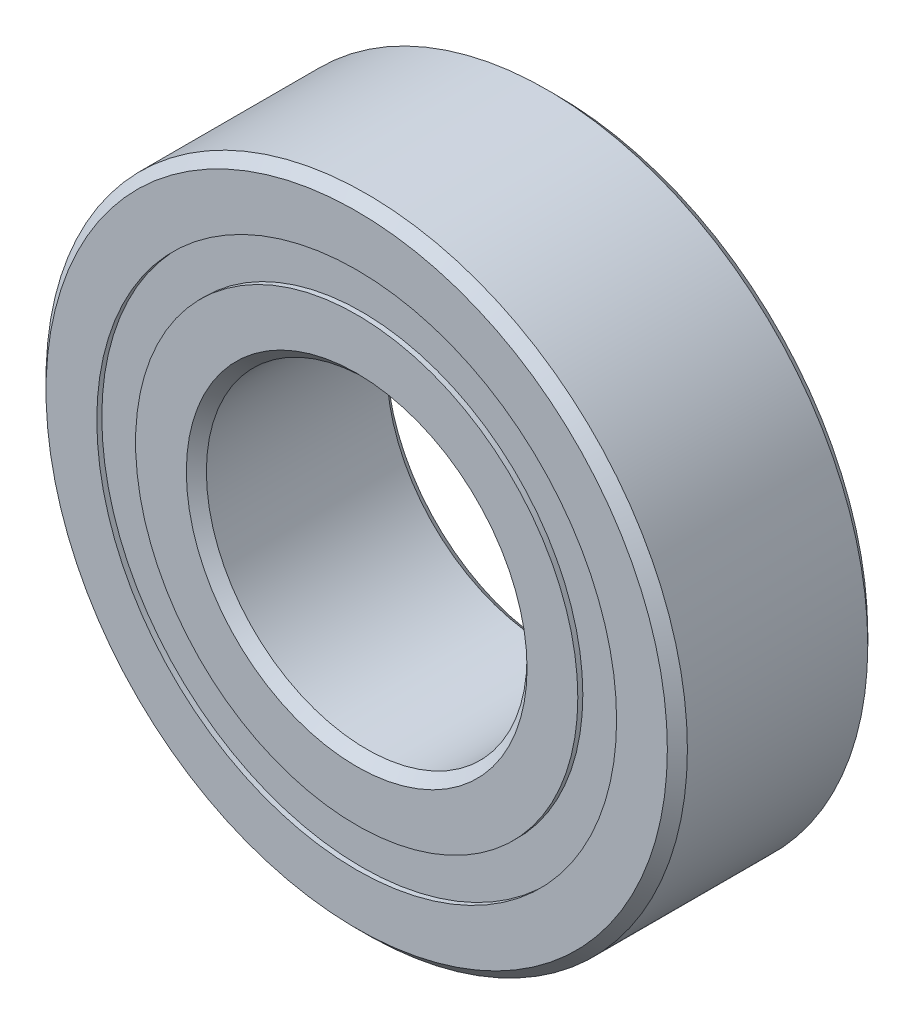
ISO-10303-21;
HEADER;
FILE_DESCRIPTION(('STEP AP214'),'2;1');
FILE_NAME('part.step','',(''),(''),'','','');
FILE_SCHEMA(('AUTOMOTIVE_DESIGN { 1 0 10303 214 1 1 1 1 }'));
ENDSEC;
DATA;
#1=APPLICATION_CONTEXT('core data for automotive mechanical design processes');
#2=APPLICATION_PROTOCOL_DEFINITION('international standard','automotive_design',2000,#1);
#3=PRODUCT_CONTEXT('',#1,'mechanical');
#4=PRODUCT('Part','Part','',(#3));
#5=PRODUCT_RELATED_PRODUCT_CATEGORY('part','',(#4));
#6=PRODUCT_DEFINITION_FORMATION('','',#4);
#7=PRODUCT_DEFINITION_CONTEXT('part definition',#1,'design');
#8=PRODUCT_DEFINITION('design','',#6,#7);
#9=PRODUCT_DEFINITION_SHAPE('','',#8);
#10=(LENGTH_UNIT() NAMED_UNIT(*) SI_UNIT(.MILLI.,.METRE.));
#11=(NAMED_UNIT(*) PLANE_ANGLE_UNIT() SI_UNIT($,.RADIAN.));
#12=(NAMED_UNIT(*) SI_UNIT($,.STERADIAN.) SOLID_ANGLE_UNIT());
#13=UNCERTAINTY_MEASURE_WITH_UNIT(LENGTH_MEASURE(1.E-05),#10,'distance_accuracy_value','');
#14=(GEOMETRIC_REPRESENTATION_CONTEXT(3) GLOBAL_UNCERTAINTY_ASSIGNED_CONTEXT((#13)) GLOBAL_UNIT_ASSIGNED_CONTEXT((#10,
#11,#12)) REPRESENTATION_CONTEXT('',''));
#15=CARTESIAN_POINT('',(0.,0.,0.));
#16=DIRECTION('',(0.,0.,1.));
#17=DIRECTION('',(1.,0.,0.));
#18=AXIS2_PLACEMENT_3D('',#15,#16,#17);
#19=CARTESIAN_POINT('',(0.,6.48351648351648,-2.375));
#20=DIRECTION('',(0.,0.,1.));
#21=DIRECTION('',(1.,0.,0.));
#22=AXIS2_PLACEMENT_3D('',#19,#20,#21);
#23=PLANE('',#22);
#24=CARTESIAN_POINT('',(0.,0.,-2.375));
#25=DIRECTION('',(0.,0.,1.));
#26=DIRECTION('',(1.,0.,0.));
#27=AXIS2_PLACEMENT_3D('',#24,#25,#26);
#28=CIRCLE('',#27,6.48351648351648);
#29=CARTESIAN_POINT('',(6.48351648351648,0.,-2.375));
#30=VERTEX_POINT('',#29);
#31=EDGE_CURVE('E60',#30,#30,#28,.T.);
#32=ORIENTED_EDGE('',*,*,#31,.F.);
#33=EDGE_LOOP('',(#32));
#34=FACE_BOUND('',#33,.T.);
#35=CARTESIAN_POINT('',(0.,0.,-2.375));
#36=DIRECTION('',(0.,0.,1.));
#37=DIRECTION('',(1.,0.,0.));
#38=AXIS2_PLACEMENT_3D('',#35,#36,#37);
#39=CIRCLE('',#38,5.51648351648352);
#40=CARTESIAN_POINT('',(5.51648351648352,0.,-2.375));
#41=VERTEX_POINT('',#40);
#42=EDGE_CURVE('E11',#41,#41,#39,.T.);
#43=ORIENTED_EDGE('',*,*,#42,.T.);
#44=EDGE_LOOP('',(#43));
#45=FACE_BOUND('',#44,.T.);
#46=ADVANCED_FACE('F46',(#34,#45),#23,.F.);
#47=CARTESIAN_POINT('',(0.,0.,2.5));
#48=DIRECTION('',(0.,0.,1.));
#49=DIRECTION('',(1.,0.,0.));
#50=AXIS2_PLACEMENT_3D('',#47,#48,#49);
#51=CYLINDRICAL_SURFACE('',#50,5.51648351648352);
#52=ORIENTED_EDGE('',*,*,#42,.F.);
#53=EDGE_LOOP('',(#52));
#54=FACE_BOUND('',#53,.T.);
#55=CARTESIAN_POINT('',(0.,0.,-1.21175743903915));
#56=DIRECTION('',(0.,0.,1.));
#57=DIRECTION('',(1.,0.,0.));
#58=AXIS2_PLACEMENT_3D('',#55,#56,#57);
#59=CIRCLE('',#58,5.51648351648352);
#60=CARTESIAN_POINT('',(5.51648351648352,0.,-1.21175743903915));
#61=VERTEX_POINT('',#60);
#62=EDGE_CURVE('E52',#61,#61,#59,.T.);
#63=ORIENTED_EDGE('',*,*,#62,.T.);
#64=EDGE_LOOP('',(#63));
#65=FACE_BOUND('',#64,.T.);
#66=ADVANCED_FACE('F69',(#54,#65),#51,.F.);
#67=CARTESIAN_POINT('',(0.,6.48351648351648,-1.21175743903915));
#68=DIRECTION('',(0.,0.,-1.));
#69=DIRECTION('',(-1.,0.,0.));
#70=AXIS2_PLACEMENT_3D('',#67,#68,#69);
#71=PLANE('',#70);
#72=ORIENTED_EDGE('',*,*,#62,.F.);
#73=EDGE_LOOP('',(#72));
#74=FACE_BOUND('',#73,.T.);
#75=CARTESIAN_POINT('',(0.,0.,-1.21175743903915));
#76=DIRECTION('',(0.,0.,1.));
#77=DIRECTION('',(1.,0.,0.));
#78=AXIS2_PLACEMENT_3D('',#75,#76,#77);
#79=CIRCLE('',#78,6.48351648351648);
#80=CARTESIAN_POINT('',(6.48351648351648,0.,-1.21175743903915));
#81=VERTEX_POINT('',#80);
#82=EDGE_CURVE('E56',#81,#81,#79,.T.);
#83=ORIENTED_EDGE('',*,*,#82,.T.);
#84=EDGE_LOOP('',(#83));
#85=FACE_BOUND('',#84,.T.);
#86=ADVANCED_FACE('F73',(#74,#85),#71,.F.);
#87=CARTESIAN_POINT('',(0.,0.,2.5));
#88=DIRECTION('',(0.,0.,1.));
#89=DIRECTION('',(1.,0.,0.));
#90=AXIS2_PLACEMENT_3D('',#87,#88,#89);
#91=CYLINDRICAL_SURFACE('',#90,6.48351648351648);
#92=ORIENTED_EDGE('',*,*,#82,.F.);
#93=EDGE_LOOP('',(#92));
#94=FACE_BOUND('',#93,.T.);
#95=ORIENTED_EDGE('',*,*,#31,.T.);
#96=EDGE_LOOP('',(#95));
#97=FACE_BOUND('',#96,.T.);
#98=ADVANCED_FACE('F66',(#94,#97),#91,.T.);
#99=CLOSED_SHELL('',(#46,#66,#86,#98));
#100=MANIFOLD_SOLID_BREP('B2',#99);
#101=CARTESIAN_POINT('',(0.,6.48351648351648,2.375));
#102=DIRECTION('',(0.,0.,-1.));
#103=DIRECTION('',(-1.,0.,0.));
#104=AXIS2_PLACEMENT_3D('',#101,#102,#103);
#105=PLANE('',#104);
#106=CARTESIAN_POINT('',(0.,0.,2.375));
#107=DIRECTION('',(0.,0.,1.));
#108=DIRECTION('',(1.,0.,0.));
#109=AXIS2_PLACEMENT_3D('',#106,#107,#108);
#110=CIRCLE('',#109,5.51648351648352);
#111=CARTESIAN_POINT('',(5.51648351648352,0.,2.375));
#112=VERTEX_POINT('',#111);
#113=EDGE_CURVE('E45',#112,#112,#110,.T.);
#114=ORIENTED_EDGE('',*,*,#113,.F.);
#115=EDGE_LOOP('',(#114));
#116=FACE_BOUND('',#115,.T.);
#117=CARTESIAN_POINT('',(0.,0.,2.375));
#118=DIRECTION('',(0.,0.,1.));
#119=DIRECTION('',(1.,0.,0.));
#120=AXIS2_PLACEMENT_3D('',#117,#118,#119);
#121=CIRCLE('',#120,6.48351648351648);
#122=CARTESIAN_POINT('',(6.48351648351648,0.,2.375));
#123=VERTEX_POINT('',#122);
#124=EDGE_CURVE('E128',#123,#123,#121,.T.);
#125=ORIENTED_EDGE('',*,*,#124,.T.);
#126=EDGE_LOOP('',(#125));
#127=FACE_BOUND('',#126,.T.);
#128=ADVANCED_FACE('F114',(#116,#127),#105,.F.);
#129=CARTESIAN_POINT('',(0.,0.,2.5));
#130=DIRECTION('',(0.,0.,1.));
#131=DIRECTION('',(1.,0.,0.));
#132=AXIS2_PLACEMENT_3D('',#129,#130,#131);
#133=CYLINDRICAL_SURFACE('',#132,5.51648351648352);
#134=CARTESIAN_POINT('',(0.,0.,1.21175743903915));
#135=DIRECTION('',(0.,0.,1.));
#136=DIRECTION('',(1.,0.,0.));
#137=AXIS2_PLACEMENT_3D('',#134,#135,#136);
#138=CIRCLE('',#137,5.51648351648352);
#139=CARTESIAN_POINT('',(5.51648351648352,0.,1.21175743903915));
#140=VERTEX_POINT('',#139);
#141=EDGE_CURVE('E120',#140,#140,#138,.T.);
#142=ORIENTED_EDGE('',*,*,#141,.F.);
#143=EDGE_LOOP('',(#142));
#144=FACE_BOUND('',#143,.T.);
#145=ORIENTED_EDGE('',*,*,#113,.T.);
#146=EDGE_LOOP('',(#145));
#147=FACE_BOUND('',#146,.T.);
#148=ADVANCED_FACE('F143',(#144,#147),#133,.F.);
#149=CARTESIAN_POINT('',(0.,6.48351648351648,1.21175743903915));
#150=DIRECTION('',(0.,0.,1.));
#151=DIRECTION('',(1.,0.,0.));
#152=AXIS2_PLACEMENT_3D('',#149,#150,#151);
#153=PLANE('',#152);
#154=CARTESIAN_POINT('',(0.,0.,1.21175743903915));
#155=DIRECTION('',(0.,0.,1.));
#156=DIRECTION('',(1.,0.,0.));
#157=AXIS2_PLACEMENT_3D('',#154,#155,#156);
#158=CIRCLE('',#157,6.48351648351648);
#159=CARTESIAN_POINT('',(6.48351648351648,0.,1.21175743903915));
#160=VERTEX_POINT('',#159);
#161=EDGE_CURVE('E124',#160,#160,#158,.T.);
#162=ORIENTED_EDGE('',*,*,#161,.F.);
#163=EDGE_LOOP('',(#162));
#164=FACE_BOUND('',#163,.T.);
#165=ORIENTED_EDGE('',*,*,#141,.T.);
#166=EDGE_LOOP('',(#165));
#167=FACE_BOUND('',#166,.T.);
#168=ADVANCED_FACE('F138',(#164,#167),#153,.F.);
#169=CARTESIAN_POINT('',(0.,0.,2.5));
#170=DIRECTION('',(0.,0.,1.));
#171=DIRECTION('',(1.,0.,0.));
#172=AXIS2_PLACEMENT_3D('',#169,#170,#171);
#173=CYLINDRICAL_SURFACE('',#172,6.48351648351648);
#174=ORIENTED_EDGE('',*,*,#124,.F.);
#175=EDGE_LOOP('',(#174));
#176=FACE_BOUND('',#175,.T.);
#177=ORIENTED_EDGE('',*,*,#161,.T.);
#178=EDGE_LOOP('',(#177));
#179=FACE_BOUND('',#178,.T.);
#180=ADVANCED_FACE('F135',(#176,#179),#173,.T.);
#181=CLOSED_SHELL('',(#128,#148,#168,#180));
#182=MANIFOLD_SOLID_BREP('B6',#181);
#183=CARTESIAN_POINT('',(-2.99999999999993,5.19615242270667,0.));
#184=DIRECTION('',(0.,0.,1.));
#185=DIRECTION('',(-0.499999999999989,0.866025403784445,0.));
#186=AXIS2_PLACEMENT_3D('',#183,#184,#185);
#187=SPHERICAL_SURFACE('',#186,1.21175743903915);
#188=CARTESIAN_POINT('',(-2.99999999999993,5.19615242270667,1.21175743903915));
#189=VERTEX_POINT('',#188);
#190=VERTEX_LOOP('',#189);
#191=FACE_BOUND('',#190,.T.);
#192=ADVANCED_FACE('F182',(#191),#187,.T.);
#193=CLOSED_SHELL('',(#192));
#194=MANIFOLD_SOLID_BREP('B40',#193);
#195=CARTESIAN_POINT('',(-5.1961524227066,3.00000000000006,0.));
#196=DIRECTION('',(0.,0.,1.));
#197=DIRECTION('',(-0.866025403784433,0.50000000000001,0.));
#198=AXIS2_PLACEMENT_3D('',#195,#196,#197);
#199=SPHERICAL_SURFACE('',#198,1.21175743903915);
#200=CARTESIAN_POINT('',(-5.1961524227066,3.00000000000006,1.21175743903915));
#201=VERTEX_POINT('',#200);
#202=VERTEX_LOOP('',#201);
#203=FACE_BOUND('',#202,.T.);
#204=ADVANCED_FACE('F203',(#203),#199,.T.);
#205=CLOSED_SHELL('',(#204));
#206=MANIFOLD_SOLID_BREP('B110',#205);
#207=CARTESIAN_POINT('',(-6.,0.,0.));
#208=DIRECTION('',(0.,0.,1.));
#209=DIRECTION('',(-1.,0.,0.));
#210=AXIS2_PLACEMENT_3D('',#207,#208,#209);
#211=SPHERICAL_SURFACE('',#210,1.21175743903915);
#212=CARTESIAN_POINT('',(-6.,0.,1.21175743903915));
#213=VERTEX_POINT('',#212);
#214=VERTEX_LOOP('',#213);
#215=FACE_BOUND('',#214,.T.);
#216=ADVANCED_FACE('F224',(#215),#211,.T.);
#217=CLOSED_SHELL('',(#216));
#218=MANIFOLD_SOLID_BREP('B178',#217);
#219=CARTESIAN_POINT('',(-5.19615242270666,-2.99999999999995,0.));
#220=DIRECTION('',(0.,0.,1.));
#221=DIRECTION('',(-0.866025403784443,-0.499999999999992,0.));
#222=AXIS2_PLACEMENT_3D('',#219,#220,#221);
#223=SPHERICAL_SURFACE('',#222,1.21175743903915);
#224=CARTESIAN_POINT('',(-5.19615242270666,-2.99999999999995,1.21175743903915));
#225=VERTEX_POINT('',#224);
#226=VERTEX_LOOP('',#225);
#227=FACE_BOUND('',#226,.T.);
#228=ADVANCED_FACE('F245',(#227),#223,.T.);
#229=CLOSED_SHELL('',(#228));
#230=MANIFOLD_SOLID_BREP('B199',#229);
#231=CARTESIAN_POINT('',(-3.00000000000004,-5.19615242270661,0.));
#232=DIRECTION('',(0.,0.,1.));
#233=DIRECTION('',(-0.500000000000007,-0.866025403784435,0.));
#234=AXIS2_PLACEMENT_3D('',#231,#232,#233);
#235=SPHERICAL_SURFACE('',#234,1.21175743903915);
#236=CARTESIAN_POINT('',(-3.00000000000004,-5.19615242270661,1.21175743903915));
#237=VERTEX_POINT('',#236);
#238=VERTEX_LOOP('',#237);
#239=FACE_BOUND('',#238,.T.);
#240=ADVANCED_FACE('F266',(#239),#235,.T.);
#241=CLOSED_SHELL('',(#240));
#242=MANIFOLD_SOLID_BREP('B220',#241);
#243=CARTESIAN_POINT('',(0.,-6.,0.));
#244=DIRECTION('',(0.,0.,1.));
#245=DIRECTION('',(0.,-1.,0.));
#246=AXIS2_PLACEMENT_3D('',#243,#244,#245);
#247=SPHERICAL_SURFACE('',#246,1.21175743903915);
#248=CARTESIAN_POINT('',(0.,-6.,1.21175743903915));
#249=VERTEX_POINT('',#248);
#250=VERTEX_LOOP('',#249);
#251=FACE_BOUND('',#250,.T.);
#252=ADVANCED_FACE('F287',(#251),#247,.T.);
#253=CLOSED_SHELL('',(#252));
#254=MANIFOLD_SOLID_BREP('B241',#253);
#255=CARTESIAN_POINT('',(2.99999999999997,-5.19615242270665,0.));
#256=DIRECTION('',(0.,0.,1.));
#257=DIRECTION('',(0.499999999999995,-0.866025403784442,0.));
#258=AXIS2_PLACEMENT_3D('',#255,#256,#257);
#259=SPHERICAL_SURFACE('',#258,1.21175743903915);
#260=CARTESIAN_POINT('',(2.99999999999997,-5.19615242270665,1.21175743903915));
#261=VERTEX_POINT('',#260);
#262=VERTEX_LOOP('',#261);
#263=FACE_BOUND('',#262,.T.);
#264=ADVANCED_FACE('F308',(#263),#259,.T.);
#265=CLOSED_SHELL('',(#264));
#266=MANIFOLD_SOLID_BREP('B262',#265);
#267=CARTESIAN_POINT('',(5.19615242270662,-3.00000000000002,0.));
#268=DIRECTION('',(0.,0.,1.));
#269=DIRECTION('',(0.866025403784436,-0.500000000000004,0.));
#270=AXIS2_PLACEMENT_3D('',#267,#268,#269);
#271=SPHERICAL_SURFACE('',#270,1.21175743903915);
#272=CARTESIAN_POINT('',(5.19615242270662,-3.00000000000002,1.21175743903915));
#273=VERTEX_POINT('',#272);
#274=VERTEX_LOOP('',#273);
#275=FACE_BOUND('',#274,.T.);
#276=ADVANCED_FACE('F329',(#275),#271,.T.);
#277=CLOSED_SHELL('',(#276));
#278=MANIFOLD_SOLID_BREP('B283',#277);
#279=CARTESIAN_POINT('',(6.,0.,0.));
#280=DIRECTION('',(0.,0.,1.));
#281=DIRECTION('',(1.,0.,0.));
#282=AXIS2_PLACEMENT_3D('',#279,#280,#281);
#283=SPHERICAL_SURFACE('',#282,1.21175743903915);
#284=CARTESIAN_POINT('',(6.,0.,1.21175743903915));
#285=VERTEX_POINT('',#284);
#286=VERTEX_LOOP('',#285);
#287=FACE_BOUND('',#286,.T.);
#288=ADVANCED_FACE('F350',(#287),#283,.T.);
#289=CLOSED_SHELL('',(#288));
#290=MANIFOLD_SOLID_BREP('B304',#289);
#291=CARTESIAN_POINT('',(5.19615242270664,2.99999999999999,0.));
#292=DIRECTION('',(0.,0.,1.));
#293=DIRECTION('',(0.86602540378444,0.499999999999998,0.));
#294=AXIS2_PLACEMENT_3D('',#291,#292,#293);
#295=SPHERICAL_SURFACE('',#294,1.21175743903915);
#296=CARTESIAN_POINT('',(5.19615242270664,2.99999999999999,1.21175743903915));
#297=VERTEX_POINT('',#296);
#298=VERTEX_LOOP('',#297);
#299=FACE_BOUND('',#298,.T.);
#300=ADVANCED_FACE('F371',(#299),#295,.T.);
#301=CLOSED_SHELL('',(#300));
#302=MANIFOLD_SOLID_BREP('B325',#301);
#303=CARTESIAN_POINT('',(3.00000000000001,5.19615242270663,0.));
#304=DIRECTION('',(0.,0.,1.));
#305=DIRECTION('',(0.500000000000001,0.866025403784438,0.));
#306=AXIS2_PLACEMENT_3D('',#303,#304,#305);
#307=SPHERICAL_SURFACE('',#306,1.21175743903915);
#308=CARTESIAN_POINT('',(3.00000000000001,5.19615242270663,1.21175743903915));
#309=VERTEX_POINT('',#308);
#310=VERTEX_LOOP('',#309);
#311=FACE_BOUND('',#310,.T.);
#312=ADVANCED_FACE('F392',(#311),#307,.T.);
#313=CLOSED_SHELL('',(#312));
#314=MANIFOLD_SOLID_BREP('B346',#313);
#315=CARTESIAN_POINT('',(0.,6.,0.));
#316=DIRECTION('',(0.,0.,1.));
#317=DIRECTION('',(0.,1.,0.));
#318=AXIS2_PLACEMENT_3D('',#315,#316,#317);
#319=SPHERICAL_SURFACE('',#318,1.21175743903915);
#320=CARTESIAN_POINT('',(0.,6.,1.21175743903915));
#321=VERTEX_POINT('',#320);
#322=VERTEX_LOOP('',#321);
#323=FACE_BOUND('',#322,.T.);
#324=ADVANCED_FACE('F415',(#323),#319,.T.);
#325=CLOSED_SHELL('',(#324));
#326=MANIFOLD_SOLID_BREP('B367',#325);
#327=CARTESIAN_POINT('',(0.,5.51648351648352,2.5));
#328=DIRECTION('',(0.,0.,-1.));
#329=DIRECTION('',(-1.,0.,0.));
#330=AXIS2_PLACEMENT_3D('',#327,#328,#329);
#331=PLANE('',#330);
#332=CARTESIAN_POINT('',(0.,0.,2.5));
#333=DIRECTION('',(0.,0.,1.));
#334=DIRECTION('',(1.,0.,0.));
#335=AXIS2_PLACEMENT_3D('',#332,#333,#334);
#336=CIRCLE('',#335,4.25);
#337=CARTESIAN_POINT('',(4.25,0.,2.5));
#338=VERTEX_POINT('',#337);
#339=EDGE_CURVE('E463',#338,#338,#336,.T.);
#340=ORIENTED_EDGE('',*,*,#339,.F.);
#341=EDGE_LOOP('',(#340));
#342=FACE_BOUND('',#341,.T.);
#343=CARTESIAN_POINT('',(0.,0.,2.5));
#344=DIRECTION('',(0.,0.,1.));
#345=DIRECTION('',(1.,0.,0.));
#346=AXIS2_PLACEMENT_3D('',#343,#344,#345);
#347=CIRCLE('',#346,5.51648351648352);
#348=CARTESIAN_POINT('',(5.51648351648352,0.,2.5));
#349=VERTEX_POINT('',#348);
#350=EDGE_CURVE('E414',#349,#349,#347,.T.);
#351=ORIENTED_EDGE('',*,*,#350,.T.);
#352=EDGE_LOOP('',(#351));
#353=FACE_BOUND('',#352,.T.);
#354=ADVANCED_FACE('F435',(#342,#353),#331,.F.);
#355=CARTESIAN_POINT('',(0.,0.,2.5));
#356=DIRECTION('',(0.,0.,1.));
#357=DIRECTION('',(1.,0.,0.));
#358=AXIS2_PLACEMENT_3D('',#355,#356,#357);
#359=CYLINDRICAL_SURFACE('',#358,5.51648351648352);
#360=ORIENTED_EDGE('',*,*,#350,.F.);
#361=EDGE_LOOP('',(#360));
#362=FACE_BOUND('',#361,.T.);
#363=CARTESIAN_POINT('',(0.,0.,1.11111111111111));
#364=DIRECTION('',(0.,0.,1.));
#365=DIRECTION('',(1.,0.,0.));
#366=AXIS2_PLACEMENT_3D('',#363,#364,#365);
#367=CIRCLE('',#366,5.51648351648352);
#368=CARTESIAN_POINT('',(5.51648351648352,0.,1.11111111111111));
#369=VERTEX_POINT('',#368);
#370=EDGE_CURVE('E441',#369,#369,#367,.T.);
#371=ORIENTED_EDGE('',*,*,#370,.T.);
#372=EDGE_LOOP('',(#371));
#373=FACE_BOUND('',#372,.T.);
#374=ADVANCED_FACE('F470',(#362,#373),#359,.T.);
#375=CARTESIAN_POINT('',(0.,0.,0.));
#376=DIRECTION('',(0.,0.,1.));
#377=DIRECTION('',(1.,0.,0.));
#378=AXIS2_PLACEMENT_3D('',#375,#376,#377);
#379=TOROIDAL_SURFACE('',#378,6.,1.21175743903915);
#380=ORIENTED_EDGE('',*,*,#370,.F.);
#381=EDGE_LOOP('',(#380));
#382=FACE_BOUND('',#381,.T.);
#383=CARTESIAN_POINT('',(0.,0.,-1.11111111111111));
#384=DIRECTION('',(0.,0.,1.));
#385=DIRECTION('',(1.,0.,0.));
#386=AXIS2_PLACEMENT_3D('',#383,#384,#385);
#387=CIRCLE('',#386,5.51648351648352);
#388=CARTESIAN_POINT('',(5.51648351648352,0.,-1.11111111111111));
#389=VERTEX_POINT('',#388);
#390=EDGE_CURVE('E445',#389,#389,#387,.T.);
#391=ORIENTED_EDGE('',*,*,#390,.T.);
#392=EDGE_LOOP('',(#391));
#393=FACE_BOUND('',#392,.T.);
#394=ADVANCED_FACE('F474',(#382,#393),#379,.F.);
#395=CARTESIAN_POINT('',(0.,0.,2.5));
#396=DIRECTION('',(0.,0.,1.));
#397=DIRECTION('',(1.,0.,0.));
#398=AXIS2_PLACEMENT_3D('',#395,#396,#397);
#399=CYLINDRICAL_SURFACE('',#398,5.51648351648352);
#400=ORIENTED_EDGE('',*,*,#390,.F.);
#401=EDGE_LOOP('',(#400));
#402=FACE_BOUND('',#401,.T.);
#403=CARTESIAN_POINT('',(0.,0.,-2.5));
#404=DIRECTION('',(0.,0.,1.));
#405=DIRECTION('',(1.,0.,0.));
#406=AXIS2_PLACEMENT_3D('',#403,#404,#405);
#407=CIRCLE('',#406,5.51648351648352);
#408=CARTESIAN_POINT('',(5.51648351648352,0.,-2.5));
#409=VERTEX_POINT('',#408);
#410=EDGE_CURVE('E449',#409,#409,#407,.T.);
#411=ORIENTED_EDGE('',*,*,#410,.T.);
#412=EDGE_LOOP('',(#411));
#413=FACE_BOUND('',#412,.T.);
#414=ADVANCED_FACE('F479',(#402,#413),#399,.T.);
#415=CARTESIAN_POINT('',(0.,4.25,-2.5));
#416=DIRECTION('',(0.,0.,1.));
#417=DIRECTION('',(1.,0.,0.));
#418=AXIS2_PLACEMENT_3D('',#415,#416,#417);
#419=PLANE('',#418);
#420=ORIENTED_EDGE('',*,*,#410,.F.);
#421=EDGE_LOOP('',(#420));
#422=FACE_BOUND('',#421,.T.);
#423=CARTESIAN_POINT('',(0.,0.,-2.5));
#424=DIRECTION('',(0.,0.,1.));
#425=DIRECTION('',(1.,0.,0.));
#426=AXIS2_PLACEMENT_3D('',#423,#424,#425);
#427=CIRCLE('',#426,4.25);
#428=CARTESIAN_POINT('',(4.25,0.,-2.5));
#429=VERTEX_POINT('',#428);
#430=EDGE_CURVE('E454',#429,#429,#427,.T.);
#431=ORIENTED_EDGE('',*,*,#430,.T.);
#432=EDGE_LOOP('',(#431));
#433=FACE_BOUND('',#432,.T.);
#434=ADVANCED_FACE('F485',(#422,#433),#419,.F.);
#435=CARTESIAN_POINT('',(0.,0.,-2.25));
#436=DIRECTION('',(0.,0.,-1.));
#437=DIRECTION('',(-1.,0.,0.));
#438=AXIS2_PLACEMENT_3D('',#435,#436,#437);
#439=CONICAL_SURFACE('',#438,4.,0.785398163397447);
#440=ORIENTED_EDGE('',*,*,#430,.F.);
#441=EDGE_LOOP('',(#440));
#442=FACE_BOUND('',#441,.T.);
#443=CARTESIAN_POINT('',(0.,0.,-2.25));
#444=DIRECTION('',(0.,0.,1.));
#445=DIRECTION('',(1.,0.,0.));
#446=AXIS2_PLACEMENT_3D('',#443,#444,#445);
#447=CIRCLE('',#446,4.);
#448=CARTESIAN_POINT('',(4.,0.,-2.25));
#449=VERTEX_POINT('',#448);
#450=EDGE_CURVE('E457',#449,#449,#447,.T.);
#451=ORIENTED_EDGE('',*,*,#450,.T.);
#452=EDGE_LOOP('',(#451));
#453=FACE_BOUND('',#452,.T.);
#454=ADVANCED_FACE('F489',(#442,#453),#439,.F.);
#455=CARTESIAN_POINT('',(0.,0.,2.5));
#456=DIRECTION('',(0.,0.,1.));
#457=DIRECTION('',(1.,0.,0.));
#458=AXIS2_PLACEMENT_3D('',#455,#456,#457);
#459=CYLINDRICAL_SURFACE('',#458,4.);
#460=ORIENTED_EDGE('',*,*,#450,.F.);
#461=EDGE_LOOP('',(#460));
#462=FACE_BOUND('',#461,.T.);
#463=CARTESIAN_POINT('',(0.,0.,2.25));
#464=DIRECTION('',(0.,0.,1.));
#465=DIRECTION('',(1.,0.,0.));
#466=AXIS2_PLACEMENT_3D('',#463,#464,#465);
#467=CIRCLE('',#466,4.);
#468=CARTESIAN_POINT('',(4.,0.,2.25));
#469=VERTEX_POINT('',#468);
#470=EDGE_CURVE('E460',#469,#469,#467,.T.);
#471=ORIENTED_EDGE('',*,*,#470,.T.);
#472=EDGE_LOOP('',(#471));
#473=FACE_BOUND('',#472,.T.);
#474=ADVANCED_FACE('F493',(#462,#473),#459,.F.);
#475=CARTESIAN_POINT('',(0.,0.,2.5));
#476=DIRECTION('',(0.,0.,1.));
#477=DIRECTION('',(1.,0.,0.));
#478=AXIS2_PLACEMENT_3D('',#475,#476,#477);
#479=CONICAL_SURFACE('',#478,4.25,0.785398163397452);
#480=ORIENTED_EDGE('',*,*,#470,.F.);
#481=EDGE_LOOP('',(#480));
#482=FACE_BOUND('',#481,.T.);
#483=ORIENTED_EDGE('',*,*,#339,.T.);
#484=EDGE_LOOP('',(#483));
#485=FACE_BOUND('',#484,.T.);
#486=ADVANCED_FACE('F467',(#482,#485),#479,.F.);
#487=CLOSED_SHELL('',(#354,#374,#394,#414,#434,#454,#474,#486));
#488=MANIFOLD_SOLID_BREP('B388',#487);
#489=CARTESIAN_POINT('',(0.,0.,2.25));
#490=DIRECTION('',(0.,0.,-1.));
#491=DIRECTION('',(-1.,0.,0.));
#492=AXIS2_PLACEMENT_3D('',#489,#490,#491);
#493=CONICAL_SURFACE('',#492,8.,0.785398163397448);
#494=CARTESIAN_POINT('',(0.,0.,2.5));
#495=DIRECTION('',(0.,0.,1.));
#496=DIRECTION('',(1.,0.,0.));
#497=AXIS2_PLACEMENT_3D('',#494,#495,#496);
#498=CIRCLE('',#497,7.75);
#499=CARTESIAN_POINT('',(7.75,0.,2.5));
#500=VERTEX_POINT('',#499);
#501=EDGE_CURVE('E585',#500,#500,#498,.T.);
#502=ORIENTED_EDGE('',*,*,#501,.F.);
#503=EDGE_LOOP('',(#502));
#504=FACE_BOUND('',#503,.T.);
#505=CARTESIAN_POINT('',(0.,0.,2.25));
#506=DIRECTION('',(0.,0.,1.));
#507=DIRECTION('',(1.,0.,0.));
#508=AXIS2_PLACEMENT_3D('',#505,#506,#507);
#509=CIRCLE('',#508,8.);
#510=CARTESIAN_POINT('',(8.,0.,2.25));
#511=VERTEX_POINT('',#510);
#512=EDGE_CURVE('E434',#511,#511,#509,.T.);
#513=ORIENTED_EDGE('',*,*,#512,.T.);
#514=EDGE_LOOP('',(#513));
#515=FACE_BOUND('',#514,.T.);
#516=ADVANCED_FACE('F557',(#504,#515),#493,.T.);
#517=CARTESIAN_POINT('',(0.,0.,2.5));
#518=DIRECTION('',(0.,0.,1.));
#519=DIRECTION('',(1.,0.,0.));
#520=AXIS2_PLACEMENT_3D('',#517,#518,#519);
#521=CYLINDRICAL_SURFACE('',#520,8.);
#522=ORIENTED_EDGE('',*,*,#512,.F.);
#523=EDGE_LOOP('',(#522));
#524=FACE_BOUND('',#523,.T.);
#525=CARTESIAN_POINT('',(0.,0.,-2.25));
#526=DIRECTION('',(0.,0.,1.));
#527=DIRECTION('',(1.,0.,0.));
#528=AXIS2_PLACEMENT_3D('',#525,#526,#527);
#529=CIRCLE('',#528,8.);
#530=CARTESIAN_POINT('',(8.,0.,-2.25));
#531=VERTEX_POINT('',#530);
#532=EDGE_CURVE('E563',#531,#531,#529,.T.);
#533=ORIENTED_EDGE('',*,*,#532,.T.);
#534=EDGE_LOOP('',(#533));
#535=FACE_BOUND('',#534,.T.);
#536=ADVANCED_FACE('F592',(#524,#535),#521,.T.);
#537=CARTESIAN_POINT('',(0.,0.,-2.5));
#538=DIRECTION('',(0.,0.,1.));
#539=DIRECTION('',(1.,0.,0.));
#540=AXIS2_PLACEMENT_3D('',#537,#538,#539);
#541=CONICAL_SURFACE('',#540,7.75,0.785398163397447);
#542=ORIENTED_EDGE('',*,*,#532,.F.);
#543=EDGE_LOOP('',(#542));
#544=FACE_BOUND('',#543,.T.);
#545=CARTESIAN_POINT('',(0.,0.,-2.5));
#546=DIRECTION('',(0.,0.,1.));
#547=DIRECTION('',(1.,0.,0.));
#548=AXIS2_PLACEMENT_3D('',#545,#546,#547);
#549=CIRCLE('',#548,7.75);
#550=CARTESIAN_POINT('',(7.75,0.,-2.5));
#551=VERTEX_POINT('',#550);
#552=EDGE_CURVE('E567',#551,#551,#549,.T.);
#553=ORIENTED_EDGE('',*,*,#552,.T.);
#554=EDGE_LOOP('',(#553));
#555=FACE_BOUND('',#554,.T.);
#556=ADVANCED_FACE('F596',(#544,#555),#541,.T.);
#557=CARTESIAN_POINT('',(0.,7.75,-2.5));
#558=DIRECTION('',(0.,0.,1.));
#559=DIRECTION('',(1.,0.,0.));
#560=AXIS2_PLACEMENT_3D('',#557,#558,#559);
#561=PLANE('',#560);
#562=ORIENTED_EDGE('',*,*,#552,.F.);
#563=EDGE_LOOP('',(#562));
#564=FACE_BOUND('',#563,.T.);
#565=CARTESIAN_POINT('',(0.,0.,-2.5));
#566=DIRECTION('',(0.,0.,1.));
#567=DIRECTION('',(1.,0.,0.));
#568=AXIS2_PLACEMENT_3D('',#565,#566,#567);
#569=CIRCLE('',#568,6.48351648351648);
#570=CARTESIAN_POINT('',(6.48351648351648,0.,-2.5));
#571=VERTEX_POINT('',#570);
#572=EDGE_CURVE('E571',#571,#571,#569,.T.);
#573=ORIENTED_EDGE('',*,*,#572,.T.);
#574=EDGE_LOOP('',(#573));
#575=FACE_BOUND('',#574,.T.);
#576=ADVANCED_FACE('F601',(#564,#575),#561,.F.);
#577=CARTESIAN_POINT('',(0.,0.,2.5));
#578=DIRECTION('',(0.,0.,1.));
#579=DIRECTION('',(1.,0.,0.));
#580=AXIS2_PLACEMENT_3D('',#577,#578,#579);
#581=CYLINDRICAL_SURFACE('',#580,6.48351648351648);
#582=ORIENTED_EDGE('',*,*,#572,.F.);
#583=EDGE_LOOP('',(#582));
#584=FACE_BOUND('',#583,.T.);
#585=CARTESIAN_POINT('',(0.,0.,-1.11111111111111));
#586=DIRECTION('',(0.,0.,1.));
#587=DIRECTION('',(1.,0.,0.));
#588=AXIS2_PLACEMENT_3D('',#585,#586,#587);
#589=CIRCLE('',#588,6.48351648351648);
#590=CARTESIAN_POINT('',(6.48351648351648,0.,-1.11111111111111));
#591=VERTEX_POINT('',#590);
#592=EDGE_CURVE('E576',#591,#591,#589,.T.);
#593=ORIENTED_EDGE('',*,*,#592,.T.);
#594=EDGE_LOOP('',(#593));
#595=FACE_BOUND('',#594,.T.);
#596=ADVANCED_FACE('F607',(#584,#595),#581,.F.);
#597=CARTESIAN_POINT('',(0.,0.,0.));
#598=DIRECTION('',(0.,0.,1.));
#599=DIRECTION('',(1.,0.,0.));
#600=AXIS2_PLACEMENT_3D('',#597,#598,#599);
#601=TOROIDAL_SURFACE('',#600,6.,1.21175743903915);
#602=ORIENTED_EDGE('',*,*,#592,.F.);
#603=EDGE_LOOP('',(#602));
#604=FACE_BOUND('',#603,.T.);
#605=CARTESIAN_POINT('',(0.,0.,1.11111111111111));
#606=DIRECTION('',(0.,0.,1.));
#607=DIRECTION('',(1.,0.,0.));
#608=AXIS2_PLACEMENT_3D('',#605,#606,#607);
#609=CIRCLE('',#608,6.48351648351648);
#610=CARTESIAN_POINT('',(6.48351648351648,0.,1.11111111111111));
#611=VERTEX_POINT('',#610);
#612=EDGE_CURVE('E579',#611,#611,#609,.T.);
#613=ORIENTED_EDGE('',*,*,#612,.T.);
#614=EDGE_LOOP('',(#613));
#615=FACE_BOUND('',#614,.T.);
#616=ADVANCED_FACE('F611',(#604,#615),#601,.F.);
#617=CARTESIAN_POINT('',(0.,0.,2.5));
#618=DIRECTION('',(0.,0.,1.));
#619=DIRECTION('',(1.,0.,0.));
#620=AXIS2_PLACEMENT_3D('',#617,#618,#619);
#621=CYLINDRICAL_SURFACE('',#620,6.48351648351648);
#622=ORIENTED_EDGE('',*,*,#612,.F.);
#623=EDGE_LOOP('',(#622));
#624=FACE_BOUND('',#623,.T.);
#625=CARTESIAN_POINT('',(0.,0.,2.5));
#626=DIRECTION('',(0.,0.,1.));
#627=DIRECTION('',(1.,0.,0.));
#628=AXIS2_PLACEMENT_3D('',#625,#626,#627);
#629=CIRCLE('',#628,6.48351648351648);
#630=CARTESIAN_POINT('',(6.48351648351648,0.,2.5));
#631=VERTEX_POINT('',#630);
#632=EDGE_CURVE('E582',#631,#631,#629,.T.);
#633=ORIENTED_EDGE('',*,*,#632,.T.);
#634=EDGE_LOOP('',(#633));
#635=FACE_BOUND('',#634,.T.);
#636=ADVANCED_FACE('F615',(#624,#635),#621,.F.);
#637=CARTESIAN_POINT('',(0.,7.75,2.5));
#638=DIRECTION('',(0.,0.,-1.));
#639=DIRECTION('',(-1.,0.,0.));
#640=AXIS2_PLACEMENT_3D('',#637,#638,#639);
#641=PLANE('',#640);
#642=ORIENTED_EDGE('',*,*,#632,.F.);
#643=EDGE_LOOP('',(#642));
#644=FACE_BOUND('',#643,.T.);
#645=ORIENTED_EDGE('',*,*,#501,.T.);
#646=EDGE_LOOP('',(#645));
#647=FACE_BOUND('',#646,.T.);
#648=ADVANCED_FACE('F589',(#644,#647),#641,.F.);
#649=CLOSED_SHELL('',(#516,#536,#556,#576,#596,#616,#636,#648));
#650=MANIFOLD_SOLID_BREP('B409',#649);
#651=ADVANCED_BREP_SHAPE_REPRESENTATION('',(#18,#100,#182,#194,#206,#218,#230,#242,#254,#266,
#278,#290,#302,#314,#326,#488,#650),#14);
#652=SHAPE_DEFINITION_REPRESENTATION(#9,#651);
ENDSEC;
END-ISO-10303-21;
